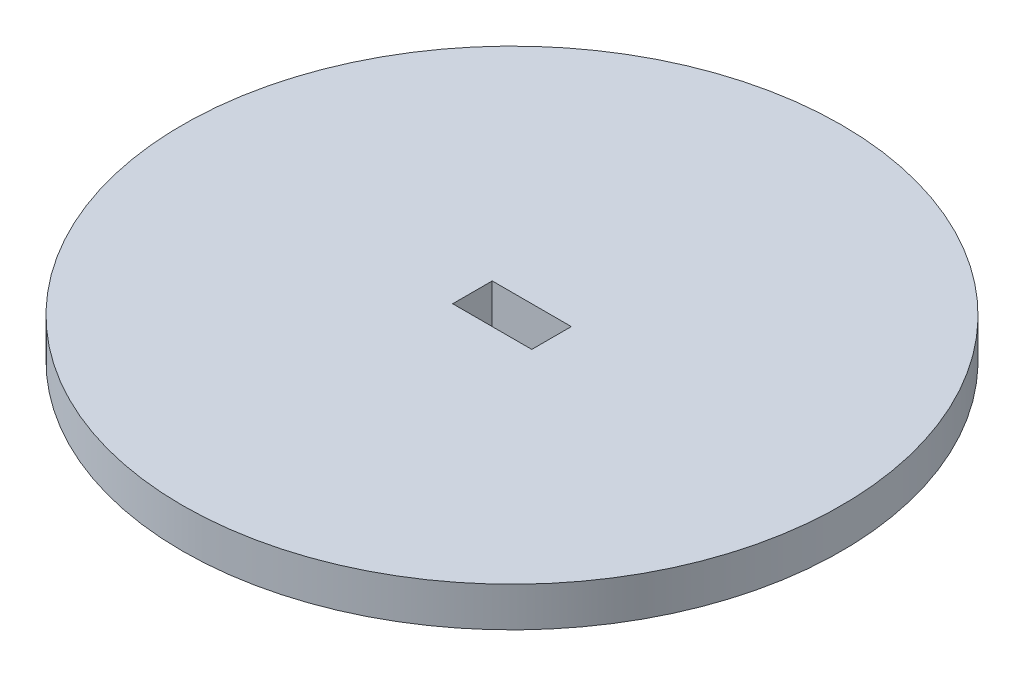
ISO-10303-21;
HEADER;
FILE_DESCRIPTION(('STEP AP214'),'2;1');
FILE_NAME('part.step','',(''),(''),'','','');
FILE_SCHEMA(('AUTOMOTIVE_DESIGN { 1 0 10303 214 1 1 1 1 }'));
ENDSEC;
DATA;
#1=APPLICATION_CONTEXT('core data for automotive mechanical design processes');
#2=APPLICATION_PROTOCOL_DEFINITION('international standard','automotive_design',2000,#1);
#3=PRODUCT_CONTEXT('',#1,'mechanical');
#4=PRODUCT('Part','Part','',(#3));
#5=PRODUCT_RELATED_PRODUCT_CATEGORY('part','',(#4));
#6=PRODUCT_DEFINITION_FORMATION('','',#4);
#7=PRODUCT_DEFINITION_CONTEXT('part definition',#1,'design');
#8=PRODUCT_DEFINITION('design','',#6,#7);
#9=PRODUCT_DEFINITION_SHAPE('','',#8);
#10=(LENGTH_UNIT() NAMED_UNIT(*) SI_UNIT(.MILLI.,.METRE.));
#11=(NAMED_UNIT(*) PLANE_ANGLE_UNIT() SI_UNIT($,.RADIAN.));
#12=(NAMED_UNIT(*) SI_UNIT($,.STERADIAN.) SOLID_ANGLE_UNIT());
#13=UNCERTAINTY_MEASURE_WITH_UNIT(LENGTH_MEASURE(1.E-05),#10,'distance_accuracy_value','');
#14=(GEOMETRIC_REPRESENTATION_CONTEXT(3) GLOBAL_UNCERTAINTY_ASSIGNED_CONTEXT((#13)) GLOBAL_UNIT_ASSIGNED_CONTEXT((#10,
#11,#12)) REPRESENTATION_CONTEXT('',''));
#15=CARTESIAN_POINT('',(0.,0.,0.));
#16=DIRECTION('',(0.,0.,1.));
#17=DIRECTION('',(1.,0.,0.));
#18=AXIS2_PLACEMENT_3D('',#15,#16,#17);
#19=CARTESIAN_POINT('',(0.,3.,0.));
#20=DIRECTION('',(0.,-1.,0.));
#21=DIRECTION('',(0.,0.,-1.));
#22=AXIS2_PLACEMENT_3D('',#19,#20,#21);
#23=CYLINDRICAL_SURFACE('',#22,25.);
#24=CARTESIAN_POINT('',(0.,3.,0.));
#25=DIRECTION('',(0.,1.,0.));
#26=DIRECTION('',(0.,0.,1.));
#27=AXIS2_PLACEMENT_3D('',#24,#25,#26);
#28=CIRCLE('',#27,25.);
#29=CARTESIAN_POINT('',(0.,3.,25.));
#30=VERTEX_POINT('',#29);
#31=EDGE_CURVE('E104',#30,#30,#28,.T.);
#32=ORIENTED_EDGE('',*,*,#31,.F.);
#33=EDGE_LOOP('',(#32));
#34=FACE_BOUND('',#33,.T.);
#35=CARTESIAN_POINT('',(0.,0.,0.));
#36=DIRECTION('',(0.,1.,0.));
#37=DIRECTION('',(0.,0.,1.));
#38=AXIS2_PLACEMENT_3D('',#35,#36,#37);
#39=CIRCLE('',#38,25.);
#40=CARTESIAN_POINT('',(0.,0.,25.));
#41=VERTEX_POINT('',#40);
#42=EDGE_CURVE('E101',#41,#41,#39,.T.);
#43=ORIENTED_EDGE('',*,*,#42,.T.);
#44=EDGE_LOOP('',(#43));
#45=FACE_BOUND('',#44,.T.);
#46=ADVANCED_FACE('F35',(#34,#45),#23,.T.);
#47=CARTESIAN_POINT('',(0.,3.,0.));
#48=DIRECTION('',(0.,1.,0.));
#49=DIRECTION('',(0.,0.,1.));
#50=AXIS2_PLACEMENT_3D('',#47,#48,#49);
#51=PLANE('',#50);
#52=DIRECTION('',(0.,0.,-1.));
#53=VECTOR('',#52,1.);
#54=CARTESIAN_POINT('',(3.,3.,1.5));
#55=LINE('',#54,#53);
#56=CARTESIAN_POINT('',(3.,3.,1.5));
#57=VERTEX_POINT('',#56);
#58=CARTESIAN_POINT('',(3.,3.,-1.5));
#59=VERTEX_POINT('',#58);
#60=EDGE_CURVE('E49',#57,#59,#55,.T.);
#61=ORIENTED_EDGE('',*,*,#60,.F.);
#62=DIRECTION('',(1.,0.,0.));
#63=VECTOR('',#62,1.);
#64=CARTESIAN_POINT('',(-3.,3.,1.5));
#65=LINE('',#64,#63);
#66=CARTESIAN_POINT('',(-3.,3.,1.5));
#67=VERTEX_POINT('',#66);
#68=EDGE_CURVE('E94',#67,#57,#65,.T.);
#69=ORIENTED_EDGE('',*,*,#68,.F.);
#70=DIRECTION('',(0.,0.,1.));
#71=VECTOR('',#70,1.);
#72=CARTESIAN_POINT('',(-3.,3.,1.5));
#73=LINE('',#72,#71);
#74=CARTESIAN_POINT('',(-3.,3.,-1.5));
#75=VERTEX_POINT('',#74);
#76=EDGE_CURVE('E78',#75,#67,#73,.T.);
#77=ORIENTED_EDGE('',*,*,#76,.F.);
#78=DIRECTION('',(-1.,0.,0.));
#79=VECTOR('',#78,1.);
#80=CARTESIAN_POINT('',(-3.,3.,-1.5));
#81=LINE('',#80,#79);
#82=EDGE_CURVE('E87',#59,#75,#81,.T.);
#83=ORIENTED_EDGE('',*,*,#82,.F.);
#84=EDGE_LOOP('',(#61,#69,#77,#83));
#85=FACE_BOUND('',#84,.T.);
#86=ORIENTED_EDGE('',*,*,#31,.T.);
#87=EDGE_LOOP('',(#86));
#88=FACE_BOUND('',#87,.T.);
#89=ADVANCED_FACE('F91',(#85,#88),#51,.T.);
#90=CARTESIAN_POINT('',(0.,0.,0.));
#91=DIRECTION('',(0.,1.,0.));
#92=DIRECTION('',(0.,0.,1.));
#93=AXIS2_PLACEMENT_3D('',#90,#91,#92);
#94=PLANE('',#93);
#95=DIRECTION('',(1.,0.,0.));
#96=VECTOR('',#95,1.);
#97=CARTESIAN_POINT('',(0.,0.,1.5));
#98=LINE('',#97,#96);
#99=CARTESIAN_POINT('',(-3.,0.,1.5));
#100=VERTEX_POINT('',#99);
#101=CARTESIAN_POINT('',(3.,0.,1.5));
#102=VERTEX_POINT('',#101);
#103=EDGE_CURVE('E42',#100,#102,#98,.T.);
#104=ORIENTED_EDGE('',*,*,#103,.T.);
#105=DIRECTION('',(0.,0.,-1.));
#106=VECTOR('',#105,1.);
#107=CARTESIAN_POINT('',(3.,0.,0.));
#108=LINE('',#107,#106);
#109=CARTESIAN_POINT('',(3.,0.,-1.5));
#110=VERTEX_POINT('',#109);
#111=EDGE_CURVE('E11',#102,#110,#108,.T.);
#112=ORIENTED_EDGE('',*,*,#111,.T.);
#113=DIRECTION('',(-1.,0.,0.));
#114=VECTOR('',#113,1.);
#115=CARTESIAN_POINT('',(0.,0.,-1.5));
#116=LINE('',#115,#114);
#117=CARTESIAN_POINT('',(-3.,0.,-1.5));
#118=VERTEX_POINT('',#117);
#119=EDGE_CURVE('E107',#110,#118,#116,.T.);
#120=ORIENTED_EDGE('',*,*,#119,.T.);
#121=DIRECTION('',(0.,0.,1.));
#122=VECTOR('',#121,1.);
#123=CARTESIAN_POINT('',(-3.,0.,0.));
#124=LINE('',#123,#122);
#125=EDGE_CURVE('E81',#118,#100,#124,.T.);
#126=ORIENTED_EDGE('',*,*,#125,.T.);
#127=EDGE_LOOP('',(#104,#112,#120,#126));
#128=FACE_BOUND('',#127,.T.);
#129=ORIENTED_EDGE('',*,*,#42,.F.);
#130=EDGE_LOOP('',(#129));
#131=FACE_BOUND('',#130,.T.);
#132=ADVANCED_FACE('F113',(#128,#131),#94,.F.);
#133=CARTESIAN_POINT('',(3.,-8.,1.5));
#134=DIRECTION('',(1.,0.,0.));
#135=DIRECTION('',(0.,0.,-1.));
#136=AXIS2_PLACEMENT_3D('',#133,#134,#135);
#137=PLANE('',#136);
#138=DIRECTION('',(0.,1.,0.));
#139=VECTOR('',#138,1.);
#140=CARTESIAN_POINT('',(3.,-8.,1.5));
#141=LINE('',#140,#139);
#142=EDGE_CURVE('E99',#102,#57,#141,.T.);
#143=ORIENTED_EDGE('',*,*,#142,.T.);
#144=ORIENTED_EDGE('',*,*,#60,.T.);
#145=DIRECTION('',(0.,1.,0.));
#146=VECTOR('',#145,1.);
#147=CARTESIAN_POINT('',(3.,-8.,-1.5));
#148=LINE('',#147,#146);
#149=EDGE_CURVE('E84',#110,#59,#148,.T.);
#150=ORIENTED_EDGE('',*,*,#149,.F.);
#151=ORIENTED_EDGE('',*,*,#111,.F.);
#152=EDGE_LOOP('',(#143,#144,#150,#151));
#153=FACE_BOUND('',#152,.T.);
#154=ADVANCED_FACE('F118',(#153),#137,.F.);
#155=CARTESIAN_POINT('',(-3.,-8.,1.5));
#156=DIRECTION('',(0.,0.,1.));
#157=DIRECTION('',(1.,0.,0.));
#158=AXIS2_PLACEMENT_3D('',#155,#156,#157);
#159=PLANE('',#158);
#160=DIRECTION('',(0.,1.,0.));
#161=VECTOR('',#160,1.);
#162=CARTESIAN_POINT('',(-3.,-8.,1.5));
#163=LINE('',#162,#161);
#164=EDGE_CURVE('E83',#100,#67,#163,.T.);
#165=ORIENTED_EDGE('',*,*,#164,.T.);
#166=ORIENTED_EDGE('',*,*,#68,.T.);
#167=ORIENTED_EDGE('',*,*,#142,.F.);
#168=ORIENTED_EDGE('',*,*,#103,.F.);
#169=EDGE_LOOP('',(#165,#166,#167,#168));
#170=FACE_BOUND('',#169,.T.);
#171=ADVANCED_FACE('F117',(#170),#159,.F.);
#172=CARTESIAN_POINT('',(-3.,-8.,1.5));
#173=DIRECTION('',(-1.,0.,0.));
#174=DIRECTION('',(0.,0.,1.));
#175=AXIS2_PLACEMENT_3D('',#172,#173,#174);
#176=PLANE('',#175);
#177=DIRECTION('',(0.,1.,0.));
#178=VECTOR('',#177,1.);
#179=CARTESIAN_POINT('',(-3.,-8.,-1.5));
#180=LINE('',#179,#178);
#181=EDGE_CURVE('E57',#118,#75,#180,.T.);
#182=ORIENTED_EDGE('',*,*,#181,.T.);
#183=ORIENTED_EDGE('',*,*,#76,.T.);
#184=ORIENTED_EDGE('',*,*,#164,.F.);
#185=ORIENTED_EDGE('',*,*,#125,.F.);
#186=EDGE_LOOP('',(#182,#183,#184,#185));
#187=FACE_BOUND('',#186,.T.);
#188=ADVANCED_FACE('F75',(#187),#176,.F.);
#189=CARTESIAN_POINT('',(-3.,-8.,-1.5));
#190=DIRECTION('',(0.,0.,-1.));
#191=DIRECTION('',(-1.,0.,0.));
#192=AXIS2_PLACEMENT_3D('',#189,#190,#191);
#193=PLANE('',#192);
#194=ORIENTED_EDGE('',*,*,#149,.T.);
#195=ORIENTED_EDGE('',*,*,#82,.T.);
#196=ORIENTED_EDGE('',*,*,#181,.F.);
#197=ORIENTED_EDGE('',*,*,#119,.F.);
#198=EDGE_LOOP('',(#194,#195,#196,#197));
#199=FACE_BOUND('',#198,.T.);
#200=ADVANCED_FACE('F88',(#199),#193,.F.);
#201=CLOSED_SHELL('',(#46,#89,#132,#154,#171,#188,#200));
#202=MANIFOLD_SOLID_BREP('B2',#201);
#203=ADVANCED_BREP_SHAPE_REPRESENTATION('',(#18,#202),#14);
#204=SHAPE_DEFINITION_REPRESENTATION(#9,#203);
ENDSEC;
END-ISO-10303-21;
